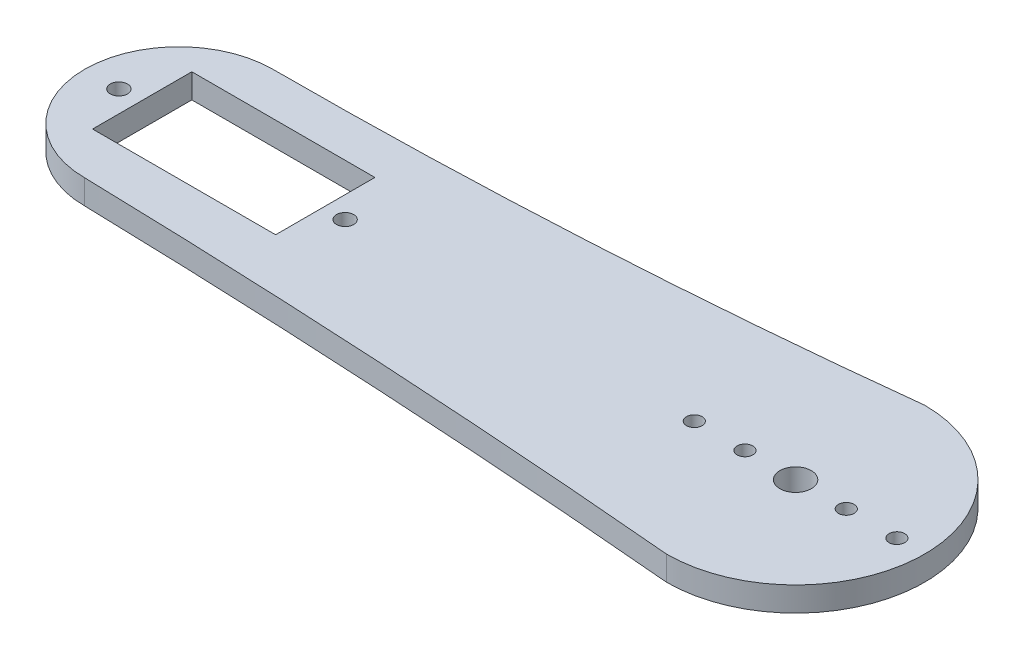
ISO-10303-21;
HEADER;
FILE_DESCRIPTION(('STEP AP214'),'2;1');
FILE_NAME('part.step','',(''),(''),'','','');
FILE_SCHEMA(('AUTOMOTIVE_DESIGN { 1 0 10303 214 1 1 1 1 }'));
ENDSEC;
DATA;
#1=APPLICATION_CONTEXT('core data for automotive mechanical design processes');
#2=APPLICATION_PROTOCOL_DEFINITION('international standard','automotive_design',2000,#1);
#3=PRODUCT_CONTEXT('',#1,'mechanical');
#4=PRODUCT('Part','Part','',(#3));
#5=PRODUCT_RELATED_PRODUCT_CATEGORY('part','',(#4));
#6=PRODUCT_DEFINITION_FORMATION('','',#4);
#7=PRODUCT_DEFINITION_CONTEXT('part definition',#1,'design');
#8=PRODUCT_DEFINITION('design','',#6,#7);
#9=PRODUCT_DEFINITION_SHAPE('','',#8);
#10=(LENGTH_UNIT() NAMED_UNIT(*) SI_UNIT(.MILLI.,.METRE.));
#11=(NAMED_UNIT(*) PLANE_ANGLE_UNIT() SI_UNIT($,.RADIAN.));
#12=(NAMED_UNIT(*) SI_UNIT($,.STERADIAN.) SOLID_ANGLE_UNIT());
#13=UNCERTAINTY_MEASURE_WITH_UNIT(LENGTH_MEASURE(1.E-05),#10,'distance_accuracy_value','');
#14=(GEOMETRIC_REPRESENTATION_CONTEXT(3) GLOBAL_UNCERTAINTY_ASSIGNED_CONTEXT((#13)) GLOBAL_UNIT_ASSIGNED_CONTEXT((#10,
#11,#12)) REPRESENTATION_CONTEXT('',''));
#15=CARTESIAN_POINT('',(0.,0.,0.));
#16=DIRECTION('',(0.,0.,1.));
#17=DIRECTION('',(1.,0.,0.));
#18=AXIS2_PLACEMENT_3D('',#15,#16,#17);
#19=CARTESIAN_POINT('',(-49.0880499478348,3.,0.));
#20=DIRECTION('',(1.,0.,0.));
#21=DIRECTION('',(0.,0.,-1.));
#22=AXIS2_PLACEMENT_3D('',#19,#20,#21);
#23=PLANE('',#22);
#24=DIRECTION('',(0.,0.,1.));
#25=VECTOR('',#24,1.);
#26=CARTESIAN_POINT('',(-49.0880499478348,0.,0.));
#27=LINE('',#26,#25);
#28=CARTESIAN_POINT('',(-49.0880499478348,0.,-21.1358109464197));
#29=VERTEX_POINT('',#28);
#30=CARTESIAN_POINT('',(-49.0880499478348,0.,-8.93581094641965));
#31=VERTEX_POINT('',#30);
#32=EDGE_CURVE('E161',#29,#31,#27,.T.);
#33=ORIENTED_EDGE('',*,*,#32,.T.);
#34=DIRECTION('',(0.,-1.,0.));
#35=VECTOR('',#34,1.);
#36=CARTESIAN_POINT('',(-49.0880499478348,3.,-8.93581094641965));
#37=LINE('',#36,#35);
#38=CARTESIAN_POINT('',(-49.0880499478348,3.,-8.93581094641965));
#39=VERTEX_POINT('',#38);
#40=EDGE_CURVE('E11',#39,#31,#37,.T.);
#41=ORIENTED_EDGE('',*,*,#40,.F.);
#42=DIRECTION('',(0.,0.,1.));
#43=VECTOR('',#42,1.);
#44=CARTESIAN_POINT('',(-49.0880499478348,3.,0.));
#45=LINE('',#44,#43);
#46=CARTESIAN_POINT('',(-49.0880499478348,3.,-21.1358109464197));
#47=VERTEX_POINT('',#46);
#48=EDGE_CURVE('E111',#47,#39,#45,.T.);
#49=ORIENTED_EDGE('',*,*,#48,.F.);
#50=DIRECTION('',(0.,-1.,0.));
#51=VECTOR('',#50,1.);
#52=CARTESIAN_POINT('',(-49.0880499478348,3.,-21.1358109464197));
#53=LINE('',#52,#51);
#54=EDGE_CURVE('E169',#47,#29,#53,.T.);
#55=ORIENTED_EDGE('',*,*,#54,.T.);
#56=EDGE_LOOP('',(#33,#41,#49,#55));
#57=FACE_BOUND('',#56,.T.);
#58=ADVANCED_FACE('F34',(#57),#23,.F.);
#59=CARTESIAN_POINT('',(0.,3.,-8.93581094641966));
#60=DIRECTION('',(0.,0.,1.));
#61=DIRECTION('',(1.,0.,0.));
#62=AXIS2_PLACEMENT_3D('',#59,#60,#61);
#63=PLANE('',#62);
#64=DIRECTION('',(-1.,0.,0.));
#65=VECTOR('',#64,1.);
#66=CARTESIAN_POINT('',(0.,0.,-8.93581094641966));
#67=LINE('',#66,#65);
#68=CARTESIAN_POINT('',(-71.5880499478348,0.,-8.93581094641965));
#69=VERTEX_POINT('',#68);
#70=EDGE_CURVE('E117',#31,#69,#67,.T.);
#71=ORIENTED_EDGE('',*,*,#70,.T.);
#72=DIRECTION('',(0.,-1.,0.));
#73=VECTOR('',#72,1.);
#74=CARTESIAN_POINT('',(-71.5880499478348,3.,-8.93581094641965));
#75=LINE('',#74,#73);
#76=CARTESIAN_POINT('',(-71.5880499478348,3.,-8.93581094641965));
#77=VERTEX_POINT('',#76);
#78=EDGE_CURVE('E44',#77,#69,#75,.T.);
#79=ORIENTED_EDGE('',*,*,#78,.F.);
#80=DIRECTION('',(-1.,0.,0.));
#81=VECTOR('',#80,1.);
#82=CARTESIAN_POINT('',(0.,3.,-8.93581094641966));
#83=LINE('',#82,#81);
#84=EDGE_CURVE('E105',#39,#77,#83,.T.);
#85=ORIENTED_EDGE('',*,*,#84,.F.);
#86=ORIENTED_EDGE('',*,*,#40,.T.);
#87=EDGE_LOOP('',(#71,#79,#85,#86));
#88=FACE_BOUND('',#87,.T.);
#89=ADVANCED_FACE('F116',(#88),#63,.F.);
#90=CARTESIAN_POINT('',(-71.5880499478348,3.,0.));
#91=DIRECTION('',(1.,0.,0.));
#92=DIRECTION('',(0.,0.,-1.));
#93=AXIS2_PLACEMENT_3D('',#90,#91,#92);
#94=PLANE('',#93);
#95=DIRECTION('',(0.,0.,1.));
#96=VECTOR('',#95,1.);
#97=CARTESIAN_POINT('',(-71.5880499478348,0.,0.));
#98=LINE('',#97,#96);
#99=CARTESIAN_POINT('',(-71.5880499478348,0.,-21.1358109464197));
#100=VERTEX_POINT('',#99);
#101=EDGE_CURVE('E165',#100,#69,#98,.T.);
#102=ORIENTED_EDGE('',*,*,#101,.F.);
#103=DIRECTION('',(0.,-1.,0.));
#104=VECTOR('',#103,1.);
#105=CARTESIAN_POINT('',(-71.5880499478348,3.,-21.1358109464197));
#106=LINE('',#105,#104);
#107=CARTESIAN_POINT('',(-71.5880499478348,3.,-21.1358109464197));
#108=VERTEX_POINT('',#107);
#109=EDGE_CURVE('E81',#108,#100,#106,.T.);
#110=ORIENTED_EDGE('',*,*,#109,.F.);
#111=DIRECTION('',(0.,0.,1.));
#112=VECTOR('',#111,1.);
#113=CARTESIAN_POINT('',(-71.5880499478348,3.,0.));
#114=LINE('',#113,#112);
#115=EDGE_CURVE('E109',#108,#77,#114,.T.);
#116=ORIENTED_EDGE('',*,*,#115,.T.);
#117=ORIENTED_EDGE('',*,*,#78,.T.);
#118=EDGE_LOOP('',(#102,#110,#116,#117));
#119=FACE_BOUND('',#118,.T.);
#120=ADVANCED_FACE('F122',(#119),#94,.T.);
#121=CARTESIAN_POINT('',(-66.8835390004601,3.,-696.926618238697));
#122=DIRECTION('',(0.,-1.,0.));
#123=DIRECTION('',(0.,0.,-1.));
#124=AXIS2_PLACEMENT_3D('',#121,#122,#123);
#125=CYLINDRICAL_SURFACE('',#124,670.546761461184);
#126=CARTESIAN_POINT('',(-66.8835390004601,0.,-696.926618238697));
#127=DIRECTION('',(0.,1.,0.));
#128=DIRECTION('',(0.,0.,1.));
#129=AXIS2_PLACEMENT_3D('',#126,#127,#128);
#130=CIRCLE('',#129,670.546761461184);
#131=CARTESIAN_POINT('',(-66.8835390004599,0.,-26.3798567775155));
#132=VERTEX_POINT('',#131);
#133=CARTESIAN_POINT('',(8.93041099954013,0.,-30.6795137110444));
#134=VERTEX_POINT('',#133);
#135=EDGE_CURVE('E128',#132,#134,#130,.T.);
#136=ORIENTED_EDGE('',*,*,#135,.F.);
#137=DIRECTION('',(0.,-1.,0.));
#138=VECTOR('',#137,1.);
#139=CARTESIAN_POINT('',(-66.8835390004599,3.,-26.3798567775155));
#140=LINE('',#139,#138);
#141=CARTESIAN_POINT('',(-66.8835390004599,3.,-26.3798567775155));
#142=VERTEX_POINT('',#141);
#143=EDGE_CURVE('E38',#142,#132,#140,.T.);
#144=ORIENTED_EDGE('',*,*,#143,.F.);
#145=CARTESIAN_POINT('',(-66.8835390004601,3.,-696.926618238697));
#146=DIRECTION('',(0.,1.,0.));
#147=DIRECTION('',(0.,0.,1.));
#148=AXIS2_PLACEMENT_3D('',#145,#146,#147);
#149=CIRCLE('',#148,670.546761461184);
#150=CARTESIAN_POINT('',(8.93041099954013,3.,-30.6795137110444));
#151=VERTEX_POINT('',#150);
#152=EDGE_CURVE('E168',#142,#151,#149,.T.);
#153=ORIENTED_EDGE('',*,*,#152,.T.);
#154=DIRECTION('',(0.,-1.,0.));
#155=VECTOR('',#154,1.);
#156=CARTESIAN_POINT('',(8.93041099954013,3.,-30.6795137110444));
#157=LINE('',#156,#155);
#158=EDGE_CURVE('E124',#151,#134,#157,.T.);
#159=ORIENTED_EDGE('',*,*,#158,.T.);
#160=EDGE_LOOP('',(#136,#144,#153,#159));
#161=FACE_BOUND('',#160,.T.);
#162=ADVANCED_FACE('F36',(#161),#125,.F.);
#163=CARTESIAN_POINT('',(-66.8835390004599,3.,-14.8230202487452));
#164=DIRECTION('',(0.,-1.,0.));
#165=DIRECTION('',(0.,0.,-1.));
#166=AXIS2_PLACEMENT_3D('',#163,#164,#165);
#167=CYLINDRICAL_SURFACE('',#166,11.5568365287703);
#168=CARTESIAN_POINT('',(-66.8835390004599,0.,-14.8230202487452));
#169=DIRECTION('',(0.,1.,0.));
#170=DIRECTION('',(0.,0.,1.));
#171=AXIS2_PLACEMENT_3D('',#168,#169,#170);
#172=CIRCLE('',#171,11.5568365287703);
#173=CARTESIAN_POINT('',(-66.8835390004599,0.,-3.26618371997493));
#174=VERTEX_POINT('',#173);
#175=EDGE_CURVE('E131',#132,#174,#172,.T.);
#176=ORIENTED_EDGE('',*,*,#175,.T.);
#177=DIRECTION('',(0.,-1.,0.));
#178=VECTOR('',#177,1.);
#179=CARTESIAN_POINT('',(-66.8835390004599,3.,-3.26618371997493));
#180=LINE('',#179,#178);
#181=CARTESIAN_POINT('',(-66.8835390004599,3.,-3.26618371997493));
#182=VERTEX_POINT('',#181);
#183=EDGE_CURVE('E174',#182,#174,#180,.T.);
#184=ORIENTED_EDGE('',*,*,#183,.F.);
#185=CARTESIAN_POINT('',(-66.8835390004599,3.,-14.8230202487452));
#186=DIRECTION('',(0.,1.,0.));
#187=DIRECTION('',(0.,0.,1.));
#188=AXIS2_PLACEMENT_3D('',#185,#186,#187);
#189=CIRCLE('',#188,11.5568365287703);
#190=EDGE_CURVE('E182',#142,#182,#189,.T.);
#191=ORIENTED_EDGE('',*,*,#190,.F.);
#192=ORIENTED_EDGE('',*,*,#143,.T.);
#193=EDGE_LOOP('',(#176,#184,#191,#192));
#194=FACE_BOUND('',#193,.T.);
#195=ADVANCED_FACE('F181',(#194),#167,.T.);
#196=CARTESIAN_POINT('',(-95.9347893297666,3.,1179.52830637457));
#197=DIRECTION('',(0.,-1.,0.));
#198=DIRECTION('',(0.,0.,-1.));
#199=AXIS2_PLACEMENT_3D('',#196,#197,#198);
#200=CYLINDRICAL_SURFACE('',#199,1183.15120797965);
#201=CARTESIAN_POINT('',(-95.9347893297666,0.,1179.52830637457));
#202=DIRECTION('',(0.,1.,0.));
#203=DIRECTION('',(0.,0.,1.));
#204=AXIS2_PLACEMENT_3D('',#201,#202,#203);
#205=CIRCLE('',#204,1183.15120797965);
#206=CARTESIAN_POINT('',(8.93041099954013,0.,1.03347367329551));
#207=VERTEX_POINT('',#206);
#208=EDGE_CURVE('E134',#207,#174,#205,.T.);
#209=ORIENTED_EDGE('',*,*,#208,.F.);
#210=DIRECTION('',(0.,-1.,0.));
#211=VECTOR('',#210,1.);
#212=CARTESIAN_POINT('',(8.93041099954013,3.,1.03347367329551));
#213=LINE('',#212,#211);
#214=CARTESIAN_POINT('',(8.93041099954013,3.,1.03347367329551));
#215=VERTEX_POINT('',#214);
#216=EDGE_CURVE('E173',#215,#207,#213,.T.);
#217=ORIENTED_EDGE('',*,*,#216,.F.);
#218=CARTESIAN_POINT('',(-95.9347893297666,3.,1179.52830637457));
#219=DIRECTION('',(0.,1.,0.));
#220=DIRECTION('',(0.,0.,1.));
#221=AXIS2_PLACEMENT_3D('',#218,#219,#220);
#222=CIRCLE('',#221,1183.15120797965);
#223=EDGE_CURVE('E194',#215,#182,#222,.T.);
#224=ORIENTED_EDGE('',*,*,#223,.T.);
#225=ORIENTED_EDGE('',*,*,#183,.T.);
#226=EDGE_LOOP('',(#209,#217,#224,#225));
#227=FACE_BOUND('',#226,.T.);
#228=ADVANCED_FACE('F192',(#227),#200,.F.);
#229=CARTESIAN_POINT('',(8.93041099954013,3.,-14.8230200188744));
#230=DIRECTION('',(0.,-1.,0.));
#231=DIRECTION('',(0.,0.,-1.));
#232=AXIS2_PLACEMENT_3D('',#229,#230,#231);
#233=CYLINDRICAL_SURFACE('',#232,1.93023);
#234=CARTESIAN_POINT('',(8.93041099954013,3.,-14.8230200188744));
#235=DIRECTION('',(0.,1.,0.));
#236=DIRECTION('',(0.,0.,1.));
#237=AXIS2_PLACEMENT_3D('',#234,#235,#236);
#238=CIRCLE('',#237,1.93023);
#239=CARTESIAN_POINT('',(8.93041099954013,3.,-12.8927900188744));
#240=VERTEX_POINT('',#239);
#241=EDGE_CURVE('E221',#240,#240,#238,.T.);
#242=ORIENTED_EDGE('',*,*,#241,.T.);
#243=EDGE_LOOP('',(#242));
#244=FACE_BOUND('',#243,.T.);
#245=CARTESIAN_POINT('',(8.93041099954013,0.,-14.8230200188744));
#246=DIRECTION('',(0.,1.,0.));
#247=DIRECTION('',(0.,0.,1.));
#248=AXIS2_PLACEMENT_3D('',#245,#246,#247);
#249=CIRCLE('',#248,1.93023);
#250=CARTESIAN_POINT('',(8.93041099954013,0.,-12.8927900188744));
#251=VERTEX_POINT('',#250);
#252=EDGE_CURVE('E158',#251,#251,#249,.T.);
#253=ORIENTED_EDGE('',*,*,#252,.F.);
#254=EDGE_LOOP('',(#253));
#255=FACE_BOUND('',#254,.T.);
#256=ADVANCED_FACE('F225',(#244,#255),#233,.F.);
#257=CARTESIAN_POINT('',(-74.2380499478348,3.,-14.8230202487452));
#258=DIRECTION('',(0.,-1.,0.));
#259=DIRECTION('',(0.,0.,-1.));
#260=AXIS2_PLACEMENT_3D('',#257,#258,#259);
#261=CYLINDRICAL_SURFACE('',#260,1.06162790697673);
#262=CARTESIAN_POINT('',(-74.2380499478348,3.,-14.8230202487452));
#263=DIRECTION('',(0.,1.,0.));
#264=DIRECTION('',(0.,0.,1.));
#265=AXIS2_PLACEMENT_3D('',#262,#263,#264);
#266=CIRCLE('',#265,1.06162790697673);
#267=CARTESIAN_POINT('',(-74.2380499478348,3.,-13.7613923417685));
#268=VERTEX_POINT('',#267);
#269=EDGE_CURVE('E218',#268,#268,#266,.T.);
#270=ORIENTED_EDGE('',*,*,#269,.T.);
#271=EDGE_LOOP('',(#270));
#272=FACE_BOUND('',#271,.T.);
#273=CARTESIAN_POINT('',(-74.2380499478348,0.,-14.8230202487452));
#274=DIRECTION('',(0.,1.,0.));
#275=DIRECTION('',(0.,0.,1.));
#276=AXIS2_PLACEMENT_3D('',#273,#274,#275);
#277=CIRCLE('',#276,1.06162790697673);
#278=CARTESIAN_POINT('',(-74.2380499478348,0.,-13.7613923417685));
#279=VERTEX_POINT('',#278);
#280=EDGE_CURVE('E155',#279,#279,#277,.T.);
#281=ORIENTED_EDGE('',*,*,#280,.F.);
#282=EDGE_LOOP('',(#281));
#283=FACE_BOUND('',#282,.T.);
#284=ADVANCED_FACE('F248',(#272,#283),#261,.F.);
#285=CARTESIAN_POINT('',(-46.4380499478348,3.,-14.8230202487452));
#286=DIRECTION('',(0.,-1.,0.));
#287=DIRECTION('',(0.,0.,-1.));
#288=AXIS2_PLACEMENT_3D('',#285,#286,#287);
#289=CYLINDRICAL_SURFACE('',#288,1.06162790697675);
#290=CARTESIAN_POINT('',(-46.4380499478348,3.,-14.8230202487452));
#291=DIRECTION('',(0.,1.,0.));
#292=DIRECTION('',(0.,0.,1.));
#293=AXIS2_PLACEMENT_3D('',#290,#291,#292);
#294=CIRCLE('',#293,1.06162790697675);
#295=CARTESIAN_POINT('',(-46.4380499478348,3.,-13.7613923417685));
#296=VERTEX_POINT('',#295);
#297=EDGE_CURVE('E215',#296,#296,#294,.T.);
#298=ORIENTED_EDGE('',*,*,#297,.T.);
#299=EDGE_LOOP('',(#298));
#300=FACE_BOUND('',#299,.T.);
#301=CARTESIAN_POINT('',(-46.4380499478348,0.,-14.8230202487452));
#302=DIRECTION('',(0.,1.,0.));
#303=DIRECTION('',(0.,0.,1.));
#304=AXIS2_PLACEMENT_3D('',#301,#302,#303);
#305=CIRCLE('',#304,1.06162790697675);
#306=CARTESIAN_POINT('',(-46.4380499478348,0.,-13.7613923417685));
#307=VERTEX_POINT('',#306);
#308=EDGE_CURVE('E152',#307,#307,#305,.T.);
#309=ORIENTED_EDGE('',*,*,#308,.F.);
#310=EDGE_LOOP('',(#309));
#311=FACE_BOUND('',#310,.T.);
#312=ADVANCED_FACE('F251',(#300,#311),#289,.F.);
#313=CARTESIAN_POINT('',(2.70541099954013,3.,-14.8230200188744));
#314=DIRECTION('',(0.,-1.,0.));
#315=DIRECTION('',(0.,0.,-1.));
#316=AXIS2_PLACEMENT_3D('',#313,#314,#315);
#317=CYLINDRICAL_SURFACE('',#316,0.965116279069762);
#318=CARTESIAN_POINT('',(2.70541099954013,3.,-14.8230200188744));
#319=DIRECTION('',(0.,1.,0.));
#320=DIRECTION('',(0.,0.,1.));
#321=AXIS2_PLACEMENT_3D('',#318,#319,#320);
#322=CIRCLE('',#321,0.965116279069762);
#323=CARTESIAN_POINT('',(2.70541099954013,3.,-13.8579037398047));
#324=VERTEX_POINT('',#323);
#325=EDGE_CURVE('E212',#324,#324,#322,.T.);
#326=ORIENTED_EDGE('',*,*,#325,.T.);
#327=EDGE_LOOP('',(#326));
#328=FACE_BOUND('',#327,.T.);
#329=CARTESIAN_POINT('',(2.70541099954013,0.,-14.8230200188744));
#330=DIRECTION('',(0.,1.,0.));
#331=DIRECTION('',(0.,0.,1.));
#332=AXIS2_PLACEMENT_3D('',#329,#330,#331);
#333=CIRCLE('',#332,0.965116279069762);
#334=CARTESIAN_POINT('',(2.70541099954013,0.,-13.8579037398047));
#335=VERTEX_POINT('',#334);
#336=EDGE_CURVE('E149',#335,#335,#333,.T.);
#337=ORIENTED_EDGE('',*,*,#336,.F.);
#338=EDGE_LOOP('',(#337));
#339=FACE_BOUND('',#338,.T.);
#340=ADVANCED_FACE('F255',(#328,#339),#317,.F.);
#341=CARTESIAN_POINT('',(-3.51958900045987,3.,-14.8230200188744));
#342=DIRECTION('',(0.,-1.,0.));
#343=DIRECTION('',(0.,0.,-1.));
#344=AXIS2_PLACEMENT_3D('',#341,#342,#343);
#345=CYLINDRICAL_SURFACE('',#344,0.965116279069771);
#346=CARTESIAN_POINT('',(-3.51958900045987,3.,-14.8230200188744));
#347=DIRECTION('',(0.,1.,0.));
#348=DIRECTION('',(0.,0.,1.));
#349=AXIS2_PLACEMENT_3D('',#346,#347,#348);
#350=CIRCLE('',#349,0.965116279069771);
#351=CARTESIAN_POINT('',(-3.51958900045987,3.,-13.8579037398047));
#352=VERTEX_POINT('',#351);
#353=EDGE_CURVE('E209',#352,#352,#350,.T.);
#354=ORIENTED_EDGE('',*,*,#353,.T.);
#355=EDGE_LOOP('',(#354));
#356=FACE_BOUND('',#355,.T.);
#357=CARTESIAN_POINT('',(-3.51958900045987,0.,-14.8230200188744));
#358=DIRECTION('',(0.,1.,0.));
#359=DIRECTION('',(0.,0.,1.));
#360=AXIS2_PLACEMENT_3D('',#357,#358,#359);
#361=CIRCLE('',#360,0.965116279069771);
#362=CARTESIAN_POINT('',(-3.51958900045987,0.,-13.8579037398047));
#363=VERTEX_POINT('',#362);
#364=EDGE_CURVE('E146',#363,#363,#361,.T.);
#365=ORIENTED_EDGE('',*,*,#364,.F.);
#366=EDGE_LOOP('',(#365));
#367=FACE_BOUND('',#366,.T.);
#368=ADVANCED_FACE('F259',(#356,#367),#345,.F.);
#369=CARTESIAN_POINT('',(15.15541,3.,-14.82302));
#370=DIRECTION('',(0.,-1.,0.));
#371=DIRECTION('',(0.,0.,-1.));
#372=AXIS2_PLACEMENT_3D('',#369,#370,#371);
#373=CYLINDRICAL_SURFACE('',#372,0.96512);
#374=CARTESIAN_POINT('',(15.15541,3.,-14.82302));
#375=DIRECTION('',(0.,1.,0.));
#376=DIRECTION('',(0.,0.,1.));
#377=AXIS2_PLACEMENT_3D('',#374,#375,#376);
#378=CIRCLE('',#377,0.96512);
#379=CARTESIAN_POINT('',(15.15541,3.,-13.8579));
#380=VERTEX_POINT('',#379);
#381=EDGE_CURVE('E206',#380,#380,#378,.T.);
#382=ORIENTED_EDGE('',*,*,#381,.T.);
#383=EDGE_LOOP('',(#382));
#384=FACE_BOUND('',#383,.T.);
#385=CARTESIAN_POINT('',(15.15541,0.,-14.82302));
#386=DIRECTION('',(0.,1.,0.));
#387=DIRECTION('',(0.,0.,1.));
#388=AXIS2_PLACEMENT_3D('',#385,#386,#387);
#389=CIRCLE('',#388,0.96512);
#390=CARTESIAN_POINT('',(15.15541,0.,-13.8579));
#391=VERTEX_POINT('',#390);
#392=EDGE_CURVE('E143',#391,#391,#389,.T.);
#393=ORIENTED_EDGE('',*,*,#392,.F.);
#394=EDGE_LOOP('',(#393));
#395=FACE_BOUND('',#394,.T.);
#396=ADVANCED_FACE('F263',(#384,#395),#373,.F.);
#397=CARTESIAN_POINT('',(21.3804090004812,3.,-14.8230200188744));
#398=DIRECTION('',(0.,-1.,0.));
#399=DIRECTION('',(0.,0.,-1.));
#400=AXIS2_PLACEMENT_3D('',#397,#398,#399);
#401=CYLINDRICAL_SURFACE('',#400,0.965119999999999);
#402=CARTESIAN_POINT('',(21.3804090004812,3.,-14.8230200188744));
#403=DIRECTION('',(0.,1.,0.));
#404=DIRECTION('',(0.,0.,1.));
#405=AXIS2_PLACEMENT_3D('',#402,#403,#404);
#406=CIRCLE('',#405,0.965119999999999);
#407=CARTESIAN_POINT('',(21.3804090004812,3.,-13.8579000188744));
#408=VERTEX_POINT('',#407);
#409=EDGE_CURVE('E197',#408,#408,#406,.T.);
#410=ORIENTED_EDGE('',*,*,#409,.T.);
#411=EDGE_LOOP('',(#410));
#412=FACE_BOUND('',#411,.T.);
#413=CARTESIAN_POINT('',(21.3804090004812,0.,-14.8230200188744));
#414=DIRECTION('',(0.,1.,0.));
#415=DIRECTION('',(0.,0.,1.));
#416=AXIS2_PLACEMENT_3D('',#413,#414,#415);
#417=CIRCLE('',#416,0.965119999999999);
#418=CARTESIAN_POINT('',(21.3804090004812,0.,-13.8579000188744));
#419=VERTEX_POINT('',#418);
#420=EDGE_CURVE('E140',#419,#419,#417,.T.);
#421=ORIENTED_EDGE('',*,*,#420,.F.);
#422=EDGE_LOOP('',(#421));
#423=FACE_BOUND('',#422,.T.);
#424=ADVANCED_FACE('F267',(#412,#423),#401,.F.);
#425=CARTESIAN_POINT('',(8.93041099954013,3.,-14.8230200188744));
#426=DIRECTION('',(0.,-1.,0.));
#427=DIRECTION('',(0.,0.,-1.));
#428=AXIS2_PLACEMENT_3D('',#425,#426,#427);
#429=CYLINDRICAL_SURFACE('',#428,15.8564936921699);
#430=CARTESIAN_POINT('',(8.93041099954013,0.,-14.8230200188744));
#431=DIRECTION('',(0.,1.,0.));
#432=DIRECTION('',(0.,0.,1.));
#433=AXIS2_PLACEMENT_3D('',#430,#431,#432);
#434=CIRCLE('',#433,15.8564936921699);
#435=EDGE_CURVE('E137',#207,#134,#434,.T.);
#436=ORIENTED_EDGE('',*,*,#435,.T.);
#437=ORIENTED_EDGE('',*,*,#158,.F.);
#438=CARTESIAN_POINT('',(8.93041099954013,3.,-14.8230200188744));
#439=DIRECTION('',(0.,1.,0.));
#440=DIRECTION('',(0.,0.,1.));
#441=AXIS2_PLACEMENT_3D('',#438,#439,#440);
#442=CIRCLE('',#441,15.8564936921699);
#443=EDGE_CURVE('E195',#215,#151,#442,.T.);
#444=ORIENTED_EDGE('',*,*,#443,.F.);
#445=ORIENTED_EDGE('',*,*,#216,.T.);
#446=EDGE_LOOP('',(#436,#437,#444,#445));
#447=FACE_BOUND('',#446,.T.);
#448=ADVANCED_FACE('F191',(#447),#429,.T.);
#449=CARTESIAN_POINT('',(0.,3.,-21.1358109464197));
#450=DIRECTION('',(0.,0.,-1.));
#451=DIRECTION('',(-1.,0.,0.));
#452=AXIS2_PLACEMENT_3D('',#449,#450,#451);
#453=PLANE('',#452);
#454=DIRECTION('',(1.,0.,0.));
#455=VECTOR('',#454,1.);
#456=CARTESIAN_POINT('',(0.,0.,-21.1358109464197));
#457=LINE('',#456,#455);
#458=EDGE_CURVE('E84',#100,#29,#457,.T.);
#459=ORIENTED_EDGE('',*,*,#458,.T.);
#460=ORIENTED_EDGE('',*,*,#54,.F.);
#461=DIRECTION('',(1.,0.,0.));
#462=VECTOR('',#461,1.);
#463=CARTESIAN_POINT('',(0.,3.,-21.1358109464197));
#464=LINE('',#463,#462);
#465=EDGE_CURVE('E53',#108,#47,#464,.T.);
#466=ORIENTED_EDGE('',*,*,#465,.F.);
#467=ORIENTED_EDGE('',*,*,#109,.T.);
#468=EDGE_LOOP('',(#459,#460,#466,#467));
#469=FACE_BOUND('',#468,.T.);
#470=ADVANCED_FACE('F229',(#469),#453,.F.);
#471=CARTESIAN_POINT('',(0.,3.,0.));
#472=DIRECTION('',(0.,1.,0.));
#473=DIRECTION('',(0.,0.,1.));
#474=AXIS2_PLACEMENT_3D('',#471,#472,#473);
#475=PLANE('',#474);
#476=ORIENTED_EDGE('',*,*,#152,.F.);
#477=ORIENTED_EDGE('',*,*,#190,.T.);
#478=ORIENTED_EDGE('',*,*,#223,.F.);
#479=ORIENTED_EDGE('',*,*,#443,.T.);
#480=EDGE_LOOP('',(#476,#477,#478,#479));
#481=FACE_BOUND('',#480,.T.);
#482=ORIENTED_EDGE('',*,*,#409,.F.);
#483=EDGE_LOOP('',(#482));
#484=FACE_BOUND('',#483,.T.);
#485=ORIENTED_EDGE('',*,*,#381,.F.);
#486=EDGE_LOOP('',(#485));
#487=FACE_BOUND('',#486,.T.);
#488=ORIENTED_EDGE('',*,*,#353,.F.);
#489=EDGE_LOOP('',(#488));
#490=FACE_BOUND('',#489,.T.);
#491=ORIENTED_EDGE('',*,*,#325,.F.);
#492=EDGE_LOOP('',(#491));
#493=FACE_BOUND('',#492,.T.);
#494=ORIENTED_EDGE('',*,*,#297,.F.);
#495=EDGE_LOOP('',(#494));
#496=FACE_BOUND('',#495,.T.);
#497=ORIENTED_EDGE('',*,*,#269,.F.);
#498=EDGE_LOOP('',(#497));
#499=FACE_BOUND('',#498,.T.);
#500=ORIENTED_EDGE('',*,*,#241,.F.);
#501=EDGE_LOOP('',(#500));
#502=FACE_BOUND('',#501,.T.);
#503=ORIENTED_EDGE('',*,*,#48,.T.);
#504=ORIENTED_EDGE('',*,*,#84,.T.);
#505=ORIENTED_EDGE('',*,*,#115,.F.);
#506=ORIENTED_EDGE('',*,*,#465,.T.);
#507=EDGE_LOOP('',(#503,#504,#505,#506));
#508=FACE_BOUND('',#507,.T.);
#509=ADVANCED_FACE('F107',(#481,#484,#487,#490,#493,#496,#499,#502,#508),#475,.T.);
#510=CARTESIAN_POINT('',(0.,0.,0.));
#511=DIRECTION('',(0.,1.,0.));
#512=DIRECTION('',(0.,0.,1.));
#513=AXIS2_PLACEMENT_3D('',#510,#511,#512);
#514=PLANE('',#513);
#515=ORIENTED_EDGE('',*,*,#135,.T.);
#516=ORIENTED_EDGE('',*,*,#435,.F.);
#517=ORIENTED_EDGE('',*,*,#208,.T.);
#518=ORIENTED_EDGE('',*,*,#175,.F.);
#519=EDGE_LOOP('',(#515,#516,#517,#518));
#520=FACE_BOUND('',#519,.T.);
#521=ORIENTED_EDGE('',*,*,#420,.T.);
#522=EDGE_LOOP('',(#521));
#523=FACE_BOUND('',#522,.T.);
#524=ORIENTED_EDGE('',*,*,#392,.T.);
#525=EDGE_LOOP('',(#524));
#526=FACE_BOUND('',#525,.T.);
#527=ORIENTED_EDGE('',*,*,#364,.T.);
#528=EDGE_LOOP('',(#527));
#529=FACE_BOUND('',#528,.T.);
#530=ORIENTED_EDGE('',*,*,#336,.T.);
#531=EDGE_LOOP('',(#530));
#532=FACE_BOUND('',#531,.T.);
#533=ORIENTED_EDGE('',*,*,#308,.T.);
#534=EDGE_LOOP('',(#533));
#535=FACE_BOUND('',#534,.T.);
#536=ORIENTED_EDGE('',*,*,#280,.T.);
#537=EDGE_LOOP('',(#536));
#538=FACE_BOUND('',#537,.T.);
#539=ORIENTED_EDGE('',*,*,#252,.T.);
#540=EDGE_LOOP('',(#539));
#541=FACE_BOUND('',#540,.T.);
#542=ORIENTED_EDGE('',*,*,#32,.F.);
#543=ORIENTED_EDGE('',*,*,#458,.F.);
#544=ORIENTED_EDGE('',*,*,#101,.T.);
#545=ORIENTED_EDGE('',*,*,#70,.F.);
#546=EDGE_LOOP('',(#542,#543,#544,#545));
#547=FACE_BOUND('',#546,.T.);
#548=ADVANCED_FACE('F185',(#520,#523,#526,#529,#532,#535,#538,#541,#547),#514,.F.);
#549=CLOSED_SHELL('',(#58,#89,#120,#162,#195,#228,#256,#284,#312,#340,#368,#396,#424,#448,#470,
#509,#548));
#550=MANIFOLD_SOLID_BREP('B2',#549);
#551=ADVANCED_BREP_SHAPE_REPRESENTATION('',(#18,#550),#14);
#552=SHAPE_DEFINITION_REPRESENTATION(#9,#551);
ENDSEC;
END-ISO-10303-21;
